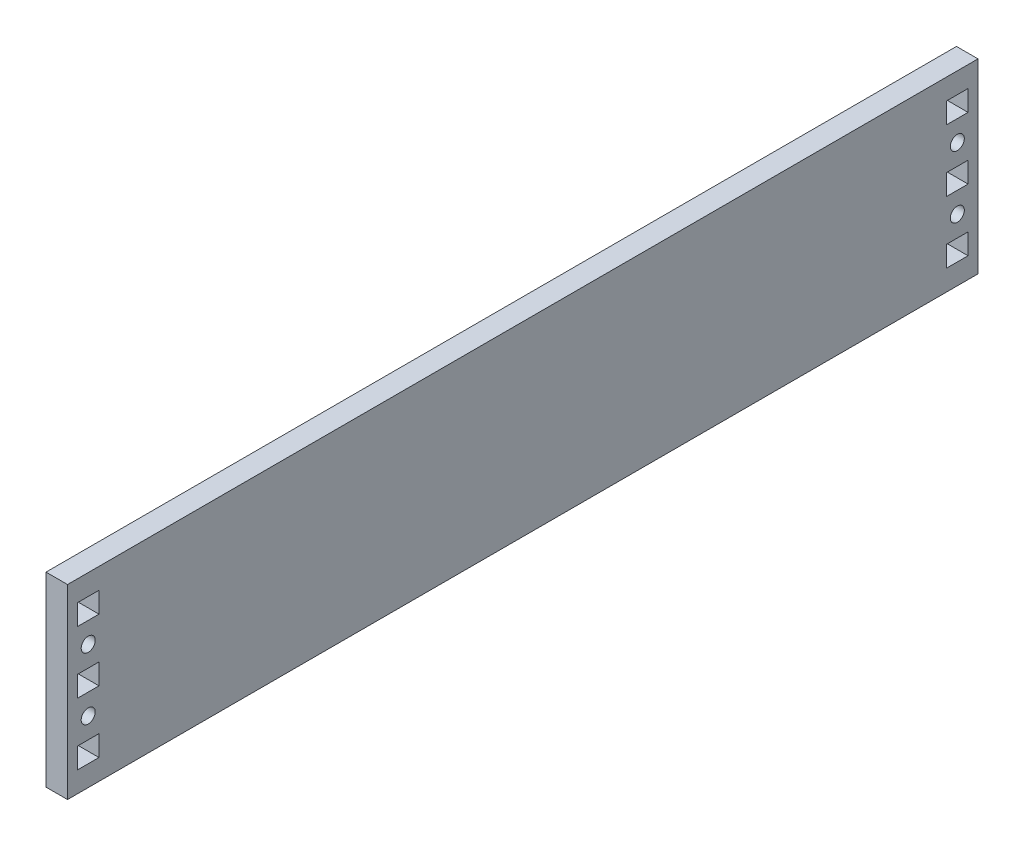
ISO-10303-21;
HEADER;
FILE_DESCRIPTION(('STEP AP214'),'2;1');
FILE_NAME('part.step','',(''),(''),'','','');
FILE_SCHEMA(('AUTOMOTIVE_DESIGN { 1 0 10303 214 1 1 1 1 }'));
ENDSEC;
DATA;
#1=APPLICATION_CONTEXT('core data for automotive mechanical design processes');
#2=APPLICATION_PROTOCOL_DEFINITION('international standard','automotive_design',2000,#1);
#3=PRODUCT_CONTEXT('',#1,'mechanical');
#4=PRODUCT('Part','Part','',(#3));
#5=PRODUCT_RELATED_PRODUCT_CATEGORY('part','',(#4));
#6=PRODUCT_DEFINITION_FORMATION('','',#4);
#7=PRODUCT_DEFINITION_CONTEXT('part definition',#1,'design');
#8=PRODUCT_DEFINITION('design','',#6,#7);
#9=PRODUCT_DEFINITION_SHAPE('','',#8);
#10=(LENGTH_UNIT() NAMED_UNIT(*) SI_UNIT(.MILLI.,.METRE.));
#11=(NAMED_UNIT(*) PLANE_ANGLE_UNIT() SI_UNIT($,.RADIAN.));
#12=(NAMED_UNIT(*) SI_UNIT($,.STERADIAN.) SOLID_ANGLE_UNIT());
#13=UNCERTAINTY_MEASURE_WITH_UNIT(LENGTH_MEASURE(1.E-05),#10,'distance_accuracy_value','');
#14=(GEOMETRIC_REPRESENTATION_CONTEXT(3) GLOBAL_UNCERTAINTY_ASSIGNED_CONTEXT((#13)) GLOBAL_UNIT_ASSIGNED_CONTEXT((#10,
#11,#12)) REPRESENTATION_CONTEXT('',''));
#15=CARTESIAN_POINT('',(0.,0.,0.));
#16=DIRECTION('',(0.,0.,1.));
#17=DIRECTION('',(1.,0.,0.));
#18=AXIS2_PLACEMENT_3D('',#15,#16,#17);
#19=CARTESIAN_POINT('',(6.604,0.,0.));
#20=DIRECTION('',(1.,0.,0.));
#21=DIRECTION('',(0.,0.,-1.));
#22=AXIS2_PLACEMENT_3D('',#19,#20,#21);
#23=PLANE('',#22);
#24=DIRECTION('',(0.,-1.,0.));
#25=VECTOR('',#24,1.);
#26=CARTESIAN_POINT('',(6.604,-15.8749999999995,-130.048));
#27=LINE('',#26,#25);
#28=CARTESIAN_POINT('',(6.604,-15.8749999999995,-130.048));
#29=VERTEX_POINT('',#28);
#30=CARTESIAN_POINT('',(6.604,-22.2249999999995,-130.048));
#31=VERTEX_POINT('',#30);
#32=EDGE_CURVE('E280',#29,#31,#27,.T.);
#33=ORIENTED_EDGE('',*,*,#32,.F.);
#34=DIRECTION('',(0.,0.,1.));
#35=VECTOR('',#34,1.);
#36=CARTESIAN_POINT('',(6.604,-15.8749999999995,-136.652));
#37=LINE('',#36,#35);
#38=CARTESIAN_POINT('',(6.604,-15.8749999999995,-136.652));
#39=VERTEX_POINT('',#38);
#40=EDGE_CURVE('E271',#39,#29,#37,.T.);
#41=ORIENTED_EDGE('',*,*,#40,.F.);
#42=DIRECTION('',(0.,1.,0.));
#43=VECTOR('',#42,1.);
#44=CARTESIAN_POINT('',(6.604,-15.8749999999995,-136.652));
#45=LINE('',#44,#43);
#46=CARTESIAN_POINT('',(6.604,-22.2249999999995,-136.652));
#47=VERTEX_POINT('',#46);
#48=EDGE_CURVE('E299',#47,#39,#45,.T.);
#49=ORIENTED_EDGE('',*,*,#48,.F.);
#50=DIRECTION('',(0.,0.,-1.));
#51=VECTOR('',#50,1.);
#52=CARTESIAN_POINT('',(6.604,-22.2249999999995,-136.652));
#53=LINE('',#52,#51);
#54=EDGE_CURVE('E294',#31,#47,#53,.T.);
#55=ORIENTED_EDGE('',*,*,#54,.F.);
#56=EDGE_LOOP('',(#33,#41,#49,#55));
#57=FACE_BOUND('',#56,.T.);
#58=DIRECTION('',(0.,-1.,0.));
#59=VECTOR('',#58,1.);
#60=CARTESIAN_POINT('',(6.604,15.875,-130.048));
#61=LINE('',#60,#59);
#62=CARTESIAN_POINT('',(6.604,22.225,-130.048));
#63=VERTEX_POINT('',#62);
#64=CARTESIAN_POINT('',(6.604,15.875,-130.048));
#65=VERTEX_POINT('',#64);
#66=EDGE_CURVE('E333',#63,#65,#61,.T.);
#67=ORIENTED_EDGE('',*,*,#66,.F.);
#68=DIRECTION('',(0.,0.,1.));
#69=VECTOR('',#68,1.);
#70=CARTESIAN_POINT('',(6.604,22.225,-130.048));
#71=LINE('',#70,#69);
#72=CARTESIAN_POINT('',(6.604,22.2249999999999,-136.652));
#73=VERTEX_POINT('',#72);
#74=EDGE_CURVE('E330',#73,#63,#71,.T.);
#75=ORIENTED_EDGE('',*,*,#74,.F.);
#76=DIRECTION('',(0.,1.,0.));
#77=VECTOR('',#76,1.);
#78=CARTESIAN_POINT('',(6.604,22.2249999999999,-136.652));
#79=LINE('',#78,#77);
#80=CARTESIAN_POINT('',(6.604,15.8749999999999,-136.652));
#81=VERTEX_POINT('',#80);
#82=EDGE_CURVE('E341',#81,#73,#79,.T.);
#83=ORIENTED_EDGE('',*,*,#82,.F.);
#84=DIRECTION('',(0.,0.,-1.));
#85=VECTOR('',#84,1.);
#86=CARTESIAN_POINT('',(6.604,15.8749999999999,-136.652));
#87=LINE('',#86,#85);
#88=EDGE_CURVE('E337',#65,#81,#87,.T.);
#89=ORIENTED_EDGE('',*,*,#88,.F.);
#90=EDGE_LOOP('',(#67,#75,#83,#89));
#91=FACE_BOUND('',#90,.T.);
#92=CARTESIAN_POINT('',(6.604,-9.52499999999965,133.35));
#93=DIRECTION('',(1.,0.,0.));
#94=DIRECTION('',(0.,0.,-1.));
#95=AXIS2_PLACEMENT_3D('',#92,#93,#94);
#96=CIRCLE('',#95,2.15265);
#97=CARTESIAN_POINT('',(6.604,-9.52499999999965,131.19735));
#98=VERTEX_POINT('',#97);
#99=EDGE_CURVE('E414',#98,#98,#96,.T.);
#100=ORIENTED_EDGE('',*,*,#99,.F.);
#101=EDGE_LOOP('',(#100));
#102=FACE_BOUND('',#101,.T.);
#103=CARTESIAN_POINT('',(6.604,9.52499999999994,133.35));
#104=DIRECTION('',(1.,0.,0.));
#105=DIRECTION('',(0.,0.,-1.));
#106=AXIS2_PLACEMENT_3D('',#103,#104,#105);
#107=CIRCLE('',#106,2.15265);
#108=CARTESIAN_POINT('',(6.604,9.52499999999994,131.19735));
#109=VERTEX_POINT('',#108);
#110=EDGE_CURVE('E465',#109,#109,#107,.T.);
#111=ORIENTED_EDGE('',*,*,#110,.F.);
#112=EDGE_LOOP('',(#111));
#113=FACE_BOUND('',#112,.T.);
#114=DIRECTION('',(0.,-1.,0.));
#115=VECTOR('',#114,1.);
#116=CARTESIAN_POINT('',(6.604,-3.17500000000006,136.652));
#117=LINE('',#116,#115);
#118=CARTESIAN_POINT('',(6.604,3.17499999999992,136.652));
#119=VERTEX_POINT('',#118);
#120=CARTESIAN_POINT('',(6.604,-3.17500000000006,136.652));
#121=VERTEX_POINT('',#120);
#122=EDGE_CURVE('E519',#119,#121,#117,.T.);
#123=ORIENTED_EDGE('',*,*,#122,.F.);
#124=DIRECTION('',(0.,0.,1.));
#125=VECTOR('',#124,1.);
#126=CARTESIAN_POINT('',(6.604,3.17499999999992,136.652));
#127=LINE('',#126,#125);
#128=CARTESIAN_POINT('',(6.604,3.17500000000008,130.048));
#129=VERTEX_POINT('',#128);
#130=EDGE_CURVE('E516',#129,#119,#127,.T.);
#131=ORIENTED_EDGE('',*,*,#130,.F.);
#132=DIRECTION('',(0.,1.,0.));
#133=VECTOR('',#132,1.);
#134=CARTESIAN_POINT('',(6.604,3.17500000000008,130.048));
#135=LINE('',#134,#133);
#136=CARTESIAN_POINT('',(6.604,-3.17500000000008,130.048));
#137=VERTEX_POINT('',#136);
#138=EDGE_CURVE('E527',#137,#129,#135,.T.);
#139=ORIENTED_EDGE('',*,*,#138,.F.);
#140=DIRECTION('',(0.,0.,-1.));
#141=VECTOR('',#140,1.);
#142=CARTESIAN_POINT('',(6.604,-3.17500000000008,130.048));
#143=LINE('',#142,#141);
#144=EDGE_CURVE('E523',#121,#137,#143,.T.);
#145=ORIENTED_EDGE('',*,*,#144,.F.);
#146=EDGE_LOOP('',(#123,#131,#139,#145));
#147=FACE_BOUND('',#146,.T.);
#148=DIRECTION('',(0.,-1.,0.));
#149=VECTOR('',#148,1.);
#150=CARTESIAN_POINT('',(6.604,28.575,139.7));
#151=LINE('',#150,#149);
#152=CARTESIAN_POINT('',(6.604,28.575,139.7));
#153=VERTEX_POINT('',#152);
#154=CARTESIAN_POINT('',(6.604,-28.575,139.7));
#155=VERTEX_POINT('',#154);
#156=EDGE_CURVE('E556',#153,#155,#151,.T.);
#157=ORIENTED_EDGE('',*,*,#156,.T.);
#158=DIRECTION('',(0.,0.,-1.));
#159=VECTOR('',#158,1.);
#160=CARTESIAN_POINT('',(6.604,-28.575,139.7));
#161=LINE('',#160,#159);
#162=CARTESIAN_POINT('',(6.604,-28.575,-139.7));
#163=VERTEX_POINT('',#162);
#164=EDGE_CURVE('E560',#155,#163,#161,.T.);
#165=ORIENTED_EDGE('',*,*,#164,.T.);
#166=DIRECTION('',(0.,1.,0.));
#167=VECTOR('',#166,1.);
#168=CARTESIAN_POINT('',(6.604,28.575,-139.7));
#169=LINE('',#168,#167);
#170=CARTESIAN_POINT('',(6.604,28.575,-139.7));
#171=VERTEX_POINT('',#170);
#172=EDGE_CURVE('E564',#163,#171,#169,.T.);
#173=ORIENTED_EDGE('',*,*,#172,.T.);
#174=DIRECTION('',(0.,0.,1.));
#175=VECTOR('',#174,1.);
#176=CARTESIAN_POINT('',(6.604,28.575,139.7));
#177=LINE('',#176,#175);
#178=EDGE_CURVE('E567',#171,#153,#177,.T.);
#179=ORIENTED_EDGE('',*,*,#178,.T.);
#180=EDGE_LOOP('',(#157,#165,#173,#179));
#181=FACE_BOUND('',#180,.T.);
#182=DIRECTION('',(0.,-1.,0.));
#183=VECTOR('',#182,1.);
#184=CARTESIAN_POINT('',(6.604,15.875,136.652));
#185=LINE('',#184,#183);
#186=CARTESIAN_POINT('',(6.604,22.2249999999999,136.652));
#187=VERTEX_POINT('',#186);
#188=CARTESIAN_POINT('',(6.604,15.875,136.652));
#189=VERTEX_POINT('',#188);
#190=EDGE_CURVE('E476',#187,#189,#185,.T.);
#191=ORIENTED_EDGE('',*,*,#190,.F.);
#192=DIRECTION('',(0.,0.,1.));
#193=VECTOR('',#192,1.);
#194=CARTESIAN_POINT('',(6.604,22.2249999999999,136.652));
#195=LINE('',#194,#193);
#196=CARTESIAN_POINT('',(6.604,22.2249999999998,130.048));
#197=VERTEX_POINT('',#196);
#198=EDGE_CURVE('E473',#197,#187,#195,.T.);
#199=ORIENTED_EDGE('',*,*,#198,.F.);
#200=DIRECTION('',(0.,1.,0.));
#201=VECTOR('',#200,1.);
#202=CARTESIAN_POINT('',(6.604,22.2249999999998,130.048));
#203=LINE('',#202,#201);
#204=CARTESIAN_POINT('',(6.604,15.8749999999998,130.048));
#205=VERTEX_POINT('',#204);
#206=EDGE_CURVE('E484',#205,#197,#203,.T.);
#207=ORIENTED_EDGE('',*,*,#206,.F.);
#208=DIRECTION('',(0.,0.,-1.));
#209=VECTOR('',#208,1.);
#210=CARTESIAN_POINT('',(6.604,15.8749999999998,130.048));
#211=LINE('',#210,#209);
#212=EDGE_CURVE('E480',#189,#205,#211,.T.);
#213=ORIENTED_EDGE('',*,*,#212,.F.);
#214=EDGE_LOOP('',(#191,#199,#207,#213));
#215=FACE_BOUND('',#214,.T.);
#216=DIRECTION('',(0.,-1.,0.));
#217=VECTOR('',#216,1.);
#218=CARTESIAN_POINT('',(6.604,-15.8749999999995,136.652));
#219=LINE('',#218,#217);
#220=CARTESIAN_POINT('',(6.604,-15.8749999999995,136.652));
#221=VERTEX_POINT('',#220);
#222=CARTESIAN_POINT('',(6.604,-22.2249999999995,136.652));
#223=VERTEX_POINT('',#222);
#224=EDGE_CURVE('E425',#221,#223,#219,.T.);
#225=ORIENTED_EDGE('',*,*,#224,.F.);
#226=DIRECTION('',(0.,0.,1.));
#227=VECTOR('',#226,1.);
#228=CARTESIAN_POINT('',(6.604,-15.8749999999995,130.048));
#229=LINE('',#228,#227);
#230=CARTESIAN_POINT('',(6.604,-15.8749999999995,130.048));
#231=VERTEX_POINT('',#230);
#232=EDGE_CURVE('E422',#231,#221,#229,.T.);
#233=ORIENTED_EDGE('',*,*,#232,.F.);
#234=DIRECTION('',(0.,1.,0.));
#235=VECTOR('',#234,1.);
#236=CARTESIAN_POINT('',(6.604,-15.8749999999995,130.048));
#237=LINE('',#236,#235);
#238=CARTESIAN_POINT('',(6.604,-22.2249999999995,130.048));
#239=VERTEX_POINT('',#238);
#240=EDGE_CURVE('E433',#239,#231,#237,.T.);
#241=ORIENTED_EDGE('',*,*,#240,.F.);
#242=DIRECTION('',(0.,0.,-1.));
#243=VECTOR('',#242,1.);
#244=CARTESIAN_POINT('',(6.604,-22.2249999999995,130.048));
#245=LINE('',#244,#243);
#246=EDGE_CURVE('E429',#223,#239,#245,.T.);
#247=ORIENTED_EDGE('',*,*,#246,.F.);
#248=EDGE_LOOP('',(#225,#233,#241,#247));
#249=FACE_BOUND('',#248,.T.);
#250=DIRECTION('',(0.,-1.,0.));
#251=VECTOR('',#250,1.);
#252=CARTESIAN_POINT('',(6.604,-3.17499999999999,-130.048));
#253=LINE('',#252,#251);
#254=CARTESIAN_POINT('',(6.604,3.17499999999999,-130.048));
#255=VERTEX_POINT('',#254);
#256=CARTESIAN_POINT('',(6.604,-3.17499999999999,-130.048));
#257=VERTEX_POINT('',#256);
#258=EDGE_CURVE('E374',#255,#257,#253,.T.);
#259=ORIENTED_EDGE('',*,*,#258,.F.);
#260=DIRECTION('',(0.,0.,1.));
#261=VECTOR('',#260,1.);
#262=CARTESIAN_POINT('',(6.604,3.17499999999999,-130.048));
#263=LINE('',#262,#261);
#264=CARTESIAN_POINT('',(6.604,3.17500000000015,-136.652));
#265=VERTEX_POINT('',#264);
#266=EDGE_CURVE('E371',#265,#255,#263,.T.);
#267=ORIENTED_EDGE('',*,*,#266,.F.);
#268=DIRECTION('',(0.,1.,0.));
#269=VECTOR('',#268,1.);
#270=CARTESIAN_POINT('',(6.604,3.17500000000015,-136.652));
#271=LINE('',#270,#269);
#272=CARTESIAN_POINT('',(6.604,-3.17500000000001,-136.652));
#273=VERTEX_POINT('',#272);
#274=EDGE_CURVE('E382',#273,#265,#271,.T.);
#275=ORIENTED_EDGE('',*,*,#274,.F.);
#276=DIRECTION('',(0.,0.,-1.));
#277=VECTOR('',#276,1.);
#278=CARTESIAN_POINT('',(6.604,-3.17500000000001,-136.652));
#279=LINE('',#278,#277);
#280=EDGE_CURVE('E378',#257,#273,#279,.T.);
#281=ORIENTED_EDGE('',*,*,#280,.F.);
#282=EDGE_LOOP('',(#259,#267,#275,#281));
#283=FACE_BOUND('',#282,.T.);
#284=CARTESIAN_POINT('',(6.604,9.52500000000001,-133.35));
#285=DIRECTION('',(1.,0.,0.));
#286=DIRECTION('',(0.,0.,-1.));
#287=AXIS2_PLACEMENT_3D('',#284,#285,#286);
#288=CIRCLE('',#287,2.15265);
#289=CARTESIAN_POINT('',(6.604,9.52500000000001,-135.50265));
#290=VERTEX_POINT('',#289);
#291=EDGE_CURVE('E322',#290,#290,#288,.T.);
#292=ORIENTED_EDGE('',*,*,#291,.F.);
#293=EDGE_LOOP('',(#292));
#294=FACE_BOUND('',#293,.T.);
#295=CARTESIAN_POINT('',(6.604,-9.52499999999959,-133.35));
#296=DIRECTION('',(1.,0.,0.));
#297=DIRECTION('',(0.,0.,-1.));
#298=AXIS2_PLACEMENT_3D('',#295,#296,#297);
#299=CIRCLE('',#298,2.15265);
#300=CARTESIAN_POINT('',(6.604,-9.52499999999959,-135.50265));
#301=VERTEX_POINT('',#300);
#302=EDGE_CURVE('E307',#301,#301,#299,.T.);
#303=ORIENTED_EDGE('',*,*,#302,.F.);
#304=EDGE_LOOP('',(#303));
#305=FACE_BOUND('',#304,.T.);
#306=ADVANCED_FACE('F39',(#57,#91,#102,#113,#147,#181,#215,#249,#283,#294,#305),#23,.T.);
#307=CARTESIAN_POINT('',(0.,0.,0.));
#308=DIRECTION('',(1.,0.,0.));
#309=DIRECTION('',(0.,0.,-1.));
#310=AXIS2_PLACEMENT_3D('',#307,#308,#309);
#311=PLANE('',#310);
#312=DIRECTION('',(0.,0.,1.));
#313=VECTOR('',#312,1.);
#314=CARTESIAN_POINT('',(0.,-15.8749999999995,-136.652));
#315=LINE('',#314,#313);
#316=CARTESIAN_POINT('',(0.,-15.8749999999995,-136.652));
#317=VERTEX_POINT('',#316);
#318=CARTESIAN_POINT('',(0.,-15.8749999999995,-130.048));
#319=VERTEX_POINT('',#318);
#320=EDGE_CURVE('E69',#317,#319,#315,.T.);
#321=ORIENTED_EDGE('',*,*,#320,.T.);
#322=DIRECTION('',(0.,-1.,0.));
#323=VECTOR('',#322,1.);
#324=CARTESIAN_POINT('',(0.,-15.8749999999995,-130.048));
#325=LINE('',#324,#323);
#326=CARTESIAN_POINT('',(0.,-22.2249999999995,-130.048));
#327=VERTEX_POINT('',#326);
#328=EDGE_CURVE('E287',#319,#327,#325,.T.);
#329=ORIENTED_EDGE('',*,*,#328,.T.);
#330=DIRECTION('',(0.,0.,-1.));
#331=VECTOR('',#330,1.);
#332=CARTESIAN_POINT('',(0.,-22.2249999999995,-136.652));
#333=LINE('',#332,#331);
#334=CARTESIAN_POINT('',(0.,-22.2249999999995,-136.652));
#335=VERTEX_POINT('',#334);
#336=EDGE_CURVE('E310',#327,#335,#333,.T.);
#337=ORIENTED_EDGE('',*,*,#336,.T.);
#338=DIRECTION('',(0.,1.,0.));
#339=VECTOR('',#338,1.);
#340=CARTESIAN_POINT('',(0.,-15.8749999999995,-136.652));
#341=LINE('',#340,#339);
#342=EDGE_CURVE('E281',#335,#317,#341,.T.);
#343=ORIENTED_EDGE('',*,*,#342,.T.);
#344=EDGE_LOOP('',(#321,#329,#337,#343));
#345=FACE_BOUND('',#344,.T.);
#346=DIRECTION('',(0.,0.,1.));
#347=VECTOR('',#346,1.);
#348=CARTESIAN_POINT('',(0.,22.225,-130.048));
#349=LINE('',#348,#347);
#350=CARTESIAN_POINT('',(0.,22.2249999999999,-136.652));
#351=VERTEX_POINT('',#350);
#352=CARTESIAN_POINT('',(0.,22.225,-130.048));
#353=VERTEX_POINT('',#352);
#354=EDGE_CURVE('E326',#351,#353,#349,.T.);
#355=ORIENTED_EDGE('',*,*,#354,.T.);
#356=DIRECTION('',(0.,-1.,0.));
#357=VECTOR('',#356,1.);
#358=CARTESIAN_POINT('',(0.,15.875,-130.048));
#359=LINE('',#358,#357);
#360=CARTESIAN_POINT('',(0.,15.875,-130.048));
#361=VERTEX_POINT('',#360);
#362=EDGE_CURVE('E347',#353,#361,#359,.T.);
#363=ORIENTED_EDGE('',*,*,#362,.T.);
#364=DIRECTION('',(0.,0.,-1.));
#365=VECTOR('',#364,1.);
#366=CARTESIAN_POINT('',(0.,15.8749999999999,-136.652));
#367=LINE('',#366,#365);
#368=CARTESIAN_POINT('',(0.,15.8749999999999,-136.652));
#369=VERTEX_POINT('',#368);
#370=EDGE_CURVE('E351',#361,#369,#367,.T.);
#371=ORIENTED_EDGE('',*,*,#370,.T.);
#372=DIRECTION('',(0.,1.,0.));
#373=VECTOR('',#372,1.);
#374=CARTESIAN_POINT('',(0.,22.2249999999999,-136.652));
#375=LINE('',#374,#373);
#376=EDGE_CURVE('E334',#369,#351,#375,.T.);
#377=ORIENTED_EDGE('',*,*,#376,.T.);
#378=EDGE_LOOP('',(#355,#363,#371,#377));
#379=FACE_BOUND('',#378,.T.);
#380=CARTESIAN_POINT('',(0.,-9.52499999999965,133.35));
#381=DIRECTION('',(1.,0.,0.));
#382=DIRECTION('',(0.,0.,-1.));
#383=AXIS2_PLACEMENT_3D('',#380,#381,#382);
#384=CIRCLE('',#383,2.15265);
#385=CARTESIAN_POINT('',(0.,-9.52499999999965,131.19735));
#386=VERTEX_POINT('',#385);
#387=EDGE_CURVE('E413',#386,#386,#384,.T.);
#388=ORIENTED_EDGE('',*,*,#387,.T.);
#389=EDGE_LOOP('',(#388));
#390=FACE_BOUND('',#389,.T.);
#391=CARTESIAN_POINT('',(0.,9.52499999999994,133.35));
#392=DIRECTION('',(1.,0.,0.));
#393=DIRECTION('',(0.,0.,-1.));
#394=AXIS2_PLACEMENT_3D('',#391,#392,#393);
#395=CIRCLE('',#394,2.15265);
#396=CARTESIAN_POINT('',(0.,9.52499999999994,131.19735));
#397=VERTEX_POINT('',#396);
#398=EDGE_CURVE('E464',#397,#397,#395,.T.);
#399=ORIENTED_EDGE('',*,*,#398,.T.);
#400=EDGE_LOOP('',(#399));
#401=FACE_BOUND('',#400,.T.);
#402=DIRECTION('',(0.,0.,1.));
#403=VECTOR('',#402,1.);
#404=CARTESIAN_POINT('',(0.,3.17499999999992,136.652));
#405=LINE('',#404,#403);
#406=CARTESIAN_POINT('',(0.,3.17500000000008,130.048));
#407=VERTEX_POINT('',#406);
#408=CARTESIAN_POINT('',(0.,3.17499999999992,136.652));
#409=VERTEX_POINT('',#408);
#410=EDGE_CURVE('E515',#407,#409,#405,.T.);
#411=ORIENTED_EDGE('',*,*,#410,.T.);
#412=DIRECTION('',(0.,-1.,0.));
#413=VECTOR('',#412,1.);
#414=CARTESIAN_POINT('',(0.,-3.17500000000006,136.652));
#415=LINE('',#414,#413);
#416=CARTESIAN_POINT('',(0.,-3.17500000000006,136.652));
#417=VERTEX_POINT('',#416);
#418=EDGE_CURVE('E534',#409,#417,#415,.T.);
#419=ORIENTED_EDGE('',*,*,#418,.T.);
#420=DIRECTION('',(0.,0.,-1.));
#421=VECTOR('',#420,1.);
#422=CARTESIAN_POINT('',(0.,-3.17500000000008,130.048));
#423=LINE('',#422,#421);
#424=CARTESIAN_POINT('',(0.,-3.17500000000008,130.048));
#425=VERTEX_POINT('',#424);
#426=EDGE_CURVE('E538',#417,#425,#423,.T.);
#427=ORIENTED_EDGE('',*,*,#426,.T.);
#428=DIRECTION('',(0.,1.,0.));
#429=VECTOR('',#428,1.);
#430=CARTESIAN_POINT('',(0.,3.17500000000008,130.048));
#431=LINE('',#430,#429);
#432=EDGE_CURVE('E520',#425,#407,#431,.T.);
#433=ORIENTED_EDGE('',*,*,#432,.T.);
#434=EDGE_LOOP('',(#411,#419,#427,#433));
#435=FACE_BOUND('',#434,.T.);
#436=DIRECTION('',(0.,-1.,0.));
#437=VECTOR('',#436,1.);
#438=CARTESIAN_POINT('',(0.,28.575,139.7));
#439=LINE('',#438,#437);
#440=CARTESIAN_POINT('',(0.,28.575,139.7));
#441=VERTEX_POINT('',#440);
#442=CARTESIAN_POINT('',(0.,-28.575,139.7));
#443=VERTEX_POINT('',#442);
#444=EDGE_CURVE('E555',#441,#443,#439,.T.);
#445=ORIENTED_EDGE('',*,*,#444,.F.);
#446=DIRECTION('',(0.,0.,1.));
#447=VECTOR('',#446,1.);
#448=CARTESIAN_POINT('',(0.,28.575,139.7));
#449=LINE('',#448,#447);
#450=CARTESIAN_POINT('',(0.,28.575,-139.7));
#451=VERTEX_POINT('',#450);
#452=EDGE_CURVE('E561',#451,#441,#449,.T.);
#453=ORIENTED_EDGE('',*,*,#452,.F.);
#454=DIRECTION('',(0.,1.,0.));
#455=VECTOR('',#454,1.);
#456=CARTESIAN_POINT('',(0.,28.575,-139.7));
#457=LINE('',#456,#455);
#458=CARTESIAN_POINT('',(0.,-28.575,-139.7));
#459=VERTEX_POINT('',#458);
#460=EDGE_CURVE('E577',#459,#451,#457,.T.);
#461=ORIENTED_EDGE('',*,*,#460,.F.);
#462=DIRECTION('',(0.,0.,-1.));
#463=VECTOR('',#462,1.);
#464=CARTESIAN_POINT('',(0.,-28.575,139.7));
#465=LINE('',#464,#463);
#466=EDGE_CURVE('E574',#443,#459,#465,.T.);
#467=ORIENTED_EDGE('',*,*,#466,.F.);
#468=EDGE_LOOP('',(#445,#453,#461,#467));
#469=FACE_BOUND('',#468,.T.);
#470=DIRECTION('',(0.,0.,1.));
#471=VECTOR('',#470,1.);
#472=CARTESIAN_POINT('',(0.,22.2249999999999,136.652));
#473=LINE('',#472,#471);
#474=CARTESIAN_POINT('',(0.,22.2249999999998,130.048));
#475=VERTEX_POINT('',#474);
#476=CARTESIAN_POINT('',(0.,22.2249999999999,136.652));
#477=VERTEX_POINT('',#476);
#478=EDGE_CURVE('E469',#475,#477,#473,.T.);
#479=ORIENTED_EDGE('',*,*,#478,.T.);
#480=DIRECTION('',(0.,-1.,0.));
#481=VECTOR('',#480,1.);
#482=CARTESIAN_POINT('',(0.,15.875,136.652));
#483=LINE('',#482,#481);
#484=CARTESIAN_POINT('',(0.,15.875,136.652));
#485=VERTEX_POINT('',#484);
#486=EDGE_CURVE('E491',#477,#485,#483,.T.);
#487=ORIENTED_EDGE('',*,*,#486,.T.);
#488=DIRECTION('',(0.,0.,-1.));
#489=VECTOR('',#488,1.);
#490=CARTESIAN_POINT('',(0.,15.8749999999998,130.048));
#491=LINE('',#490,#489);
#492=CARTESIAN_POINT('',(0.,15.8749999999998,130.048));
#493=VERTEX_POINT('',#492);
#494=EDGE_CURVE('E495',#485,#493,#491,.T.);
#495=ORIENTED_EDGE('',*,*,#494,.T.);
#496=DIRECTION('',(0.,1.,0.));
#497=VECTOR('',#496,1.);
#498=CARTESIAN_POINT('',(0.,22.2249999999998,130.048));
#499=LINE('',#498,#497);
#500=EDGE_CURVE('E477',#493,#475,#499,.T.);
#501=ORIENTED_EDGE('',*,*,#500,.T.);
#502=EDGE_LOOP('',(#479,#487,#495,#501));
#503=FACE_BOUND('',#502,.T.);
#504=DIRECTION('',(0.,0.,1.));
#505=VECTOR('',#504,1.);
#506=CARTESIAN_POINT('',(0.,-15.8749999999995,130.048));
#507=LINE('',#506,#505);
#508=CARTESIAN_POINT('',(0.,-15.8749999999995,130.048));
#509=VERTEX_POINT('',#508);
#510=CARTESIAN_POINT('',(0.,-15.8749999999995,136.652));
#511=VERTEX_POINT('',#510);
#512=EDGE_CURVE('E418',#509,#511,#507,.T.);
#513=ORIENTED_EDGE('',*,*,#512,.T.);
#514=DIRECTION('',(0.,-1.,0.));
#515=VECTOR('',#514,1.);
#516=CARTESIAN_POINT('',(0.,-15.8749999999995,136.652));
#517=LINE('',#516,#515);
#518=CARTESIAN_POINT('',(0.,-22.2249999999995,136.652));
#519=VERTEX_POINT('',#518);
#520=EDGE_CURVE('E440',#511,#519,#517,.T.);
#521=ORIENTED_EDGE('',*,*,#520,.T.);
#522=DIRECTION('',(0.,0.,-1.));
#523=VECTOR('',#522,1.);
#524=CARTESIAN_POINT('',(0.,-22.2249999999995,130.048));
#525=LINE('',#524,#523);
#526=CARTESIAN_POINT('',(0.,-22.2249999999995,130.048));
#527=VERTEX_POINT('',#526);
#528=EDGE_CURVE('E444',#519,#527,#525,.T.);
#529=ORIENTED_EDGE('',*,*,#528,.T.);
#530=DIRECTION('',(0.,1.,0.));
#531=VECTOR('',#530,1.);
#532=CARTESIAN_POINT('',(0.,-15.8749999999995,130.048));
#533=LINE('',#532,#531);
#534=EDGE_CURVE('E426',#527,#509,#533,.T.);
#535=ORIENTED_EDGE('',*,*,#534,.T.);
#536=EDGE_LOOP('',(#513,#521,#529,#535));
#537=FACE_BOUND('',#536,.T.);
#538=DIRECTION('',(0.,0.,1.));
#539=VECTOR('',#538,1.);
#540=CARTESIAN_POINT('',(0.,3.17499999999999,-130.048));
#541=LINE('',#540,#539);
#542=CARTESIAN_POINT('',(0.,3.17500000000015,-136.652));
#543=VERTEX_POINT('',#542);
#544=CARTESIAN_POINT('',(0.,3.17499999999999,-130.048));
#545=VERTEX_POINT('',#544);
#546=EDGE_CURVE('E370',#543,#545,#541,.T.);
#547=ORIENTED_EDGE('',*,*,#546,.T.);
#548=DIRECTION('',(0.,-1.,0.));
#549=VECTOR('',#548,1.);
#550=CARTESIAN_POINT('',(0.,-3.17499999999999,-130.048));
#551=LINE('',#550,#549);
#552=CARTESIAN_POINT('',(0.,-3.17499999999999,-130.048));
#553=VERTEX_POINT('',#552);
#554=EDGE_CURVE('E389',#545,#553,#551,.T.);
#555=ORIENTED_EDGE('',*,*,#554,.T.);
#556=DIRECTION('',(0.,0.,-1.));
#557=VECTOR('',#556,1.);
#558=CARTESIAN_POINT('',(0.,-3.17500000000001,-136.652));
#559=LINE('',#558,#557);
#560=CARTESIAN_POINT('',(0.,-3.17500000000001,-136.652));
#561=VERTEX_POINT('',#560);
#562=EDGE_CURVE('E393',#553,#561,#559,.T.);
#563=ORIENTED_EDGE('',*,*,#562,.T.);
#564=DIRECTION('',(0.,1.,0.));
#565=VECTOR('',#564,1.);
#566=CARTESIAN_POINT('',(0.,3.17500000000015,-136.652));
#567=LINE('',#566,#565);
#568=EDGE_CURVE('E375',#561,#543,#567,.T.);
#569=ORIENTED_EDGE('',*,*,#568,.T.);
#570=EDGE_LOOP('',(#547,#555,#563,#569));
#571=FACE_BOUND('',#570,.T.);
#572=CARTESIAN_POINT('',(0.,9.52500000000001,-133.35));
#573=DIRECTION('',(1.,0.,0.));
#574=DIRECTION('',(0.,0.,-1.));
#575=AXIS2_PLACEMENT_3D('',#572,#573,#574);
#576=CIRCLE('',#575,2.15265);
#577=CARTESIAN_POINT('',(0.,9.52500000000001,-135.50265));
#578=VERTEX_POINT('',#577);
#579=EDGE_CURVE('E289',#578,#578,#576,.T.);
#580=ORIENTED_EDGE('',*,*,#579,.T.);
#581=EDGE_LOOP('',(#580));
#582=FACE_BOUND('',#581,.T.);
#583=CARTESIAN_POINT('',(0.,-9.52499999999959,-133.35));
#584=DIRECTION('',(1.,0.,0.));
#585=DIRECTION('',(0.,0.,-1.));
#586=AXIS2_PLACEMENT_3D('',#583,#584,#585);
#587=CIRCLE('',#586,2.15265);
#588=CARTESIAN_POINT('',(0.,-9.52499999999959,-135.50265));
#589=VERTEX_POINT('',#588);
#590=EDGE_CURVE('E757',#589,#589,#587,.T.);
#591=ORIENTED_EDGE('',*,*,#590,.T.);
#592=EDGE_LOOP('',(#591));
#593=FACE_BOUND('',#592,.T.);
#594=ADVANCED_FACE('F599',(#345,#379,#390,#401,#435,#469,#503,#537,#571,#582,#593),#311,.F.);
#595=CARTESIAN_POINT('',(6.604,28.575,139.7));
#596=DIRECTION('',(0.,0.,-1.));
#597=DIRECTION('',(0.,1.,0.));
#598=AXIS2_PLACEMENT_3D('',#595,#596,#597);
#599=PLANE('',#598);
#600=ORIENTED_EDGE('',*,*,#444,.T.);
#601=DIRECTION('',(-1.,0.,0.));
#602=VECTOR('',#601,1.);
#603=CARTESIAN_POINT('',(6.604,-28.575,139.7));
#604=LINE('',#603,#602);
#605=EDGE_CURVE('E11',#155,#443,#604,.T.);
#606=ORIENTED_EDGE('',*,*,#605,.F.);
#607=ORIENTED_EDGE('',*,*,#156,.F.);
#608=DIRECTION('',(-1.,0.,0.));
#609=VECTOR('',#608,1.);
#610=CARTESIAN_POINT('',(6.604,28.575,139.7));
#611=LINE('',#610,#609);
#612=EDGE_CURVE('E570',#153,#441,#611,.T.);
#613=ORIENTED_EDGE('',*,*,#612,.T.);
#614=EDGE_LOOP('',(#600,#606,#607,#613));
#615=FACE_BOUND('',#614,.T.);
#616=ADVANCED_FACE('F41',(#615),#599,.F.);
#617=CARTESIAN_POINT('',(6.604,-28.575,139.7));
#618=DIRECTION('',(0.,1.,0.));
#619=DIRECTION('',(0.,0.,1.));
#620=AXIS2_PLACEMENT_3D('',#617,#618,#619);
#621=PLANE('',#620);
#622=ORIENTED_EDGE('',*,*,#466,.T.);
#623=DIRECTION('',(-1.,0.,0.));
#624=VECTOR('',#623,1.);
#625=CARTESIAN_POINT('',(6.604,-28.575,-139.7));
#626=LINE('',#625,#624);
#627=EDGE_CURVE('E48',#163,#459,#626,.T.);
#628=ORIENTED_EDGE('',*,*,#627,.F.);
#629=ORIENTED_EDGE('',*,*,#164,.F.);
#630=ORIENTED_EDGE('',*,*,#605,.T.);
#631=EDGE_LOOP('',(#622,#628,#629,#630));
#632=FACE_BOUND('',#631,.T.);
#633=ADVANCED_FACE('F610',(#632),#621,.F.);
#634=CARTESIAN_POINT('',(6.604,28.575,-139.7));
#635=DIRECTION('',(0.,0.,1.));
#636=DIRECTION('',(1.,0.,0.));
#637=AXIS2_PLACEMENT_3D('',#634,#635,#636);
#638=PLANE('',#637);
#639=ORIENTED_EDGE('',*,*,#460,.T.);
#640=DIRECTION('',(-1.,0.,0.));
#641=VECTOR('',#640,1.);
#642=CARTESIAN_POINT('',(6.604,28.575,-139.7));
#643=LINE('',#642,#641);
#644=EDGE_CURVE('E584',#171,#451,#643,.T.);
#645=ORIENTED_EDGE('',*,*,#644,.F.);
#646=ORIENTED_EDGE('',*,*,#172,.F.);
#647=ORIENTED_EDGE('',*,*,#627,.T.);
#648=EDGE_LOOP('',(#639,#645,#646,#647));
#649=FACE_BOUND('',#648,.T.);
#650=ADVANCED_FACE('F593',(#649),#638,.F.);
#651=CARTESIAN_POINT('',(6.604,28.575,139.7));
#652=DIRECTION('',(0.,-1.,0.));
#653=DIRECTION('',(0.,0.,-1.));
#654=AXIS2_PLACEMENT_3D('',#651,#652,#653);
#655=PLANE('',#654);
#656=ORIENTED_EDGE('',*,*,#452,.T.);
#657=ORIENTED_EDGE('',*,*,#612,.F.);
#658=ORIENTED_EDGE('',*,*,#178,.F.);
#659=ORIENTED_EDGE('',*,*,#644,.T.);
#660=EDGE_LOOP('',(#656,#657,#658,#659));
#661=FACE_BOUND('',#660,.T.);
#662=ADVANCED_FACE('F603',(#661),#655,.F.);
#663=CARTESIAN_POINT('',(6.604,3.17499999999992,136.652));
#664=DIRECTION('',(0.,-1.,0.));
#665=DIRECTION('',(0.,0.,-1.));
#666=AXIS2_PLACEMENT_3D('',#663,#664,#665);
#667=PLANE('',#666);
#668=ORIENTED_EDGE('',*,*,#410,.F.);
#669=DIRECTION('',(-1.,0.,0.));
#670=VECTOR('',#669,1.);
#671=CARTESIAN_POINT('',(6.604,3.17500000000008,130.048));
#672=LINE('',#671,#670);
#673=EDGE_CURVE('E530',#129,#407,#672,.T.);
#674=ORIENTED_EDGE('',*,*,#673,.F.);
#675=ORIENTED_EDGE('',*,*,#130,.T.);
#676=DIRECTION('',(-1.,0.,0.));
#677=VECTOR('',#676,1.);
#678=CARTESIAN_POINT('',(6.604,3.17499999999992,136.652));
#679=LINE('',#678,#677);
#680=EDGE_CURVE('E551',#119,#409,#679,.T.);
#681=ORIENTED_EDGE('',*,*,#680,.T.);
#682=EDGE_LOOP('',(#668,#674,#675,#681));
#683=FACE_BOUND('',#682,.T.);
#684=ADVANCED_FACE('F625',(#683),#667,.T.);
#685=CARTESIAN_POINT('',(6.604,-3.17500000000006,136.652));
#686=DIRECTION('',(0.,0.,-1.));
#687=DIRECTION('',(0.,1.,0.));
#688=AXIS2_PLACEMENT_3D('',#685,#686,#687);
#689=PLANE('',#688);
#690=ORIENTED_EDGE('',*,*,#418,.F.);
#691=ORIENTED_EDGE('',*,*,#680,.F.);
#692=ORIENTED_EDGE('',*,*,#122,.T.);
#693=DIRECTION('',(-1.,0.,0.));
#694=VECTOR('',#693,1.);
#695=CARTESIAN_POINT('',(6.604,-3.17500000000006,136.652));
#696=LINE('',#695,#694);
#697=EDGE_CURVE('E549',#121,#417,#696,.T.);
#698=ORIENTED_EDGE('',*,*,#697,.T.);
#699=EDGE_LOOP('',(#690,#691,#692,#698));
#700=FACE_BOUND('',#699,.T.);
#701=ADVANCED_FACE('F632',(#700),#689,.T.);
#702=CARTESIAN_POINT('',(6.604,-3.17500000000008,130.048));
#703=DIRECTION('',(0.,1.,0.));
#704=DIRECTION('',(0.,0.,1.));
#705=AXIS2_PLACEMENT_3D('',#702,#703,#704);
#706=PLANE('',#705);
#707=ORIENTED_EDGE('',*,*,#426,.F.);
#708=ORIENTED_EDGE('',*,*,#697,.F.);
#709=ORIENTED_EDGE('',*,*,#144,.T.);
#710=DIRECTION('',(-1.,0.,0.));
#711=VECTOR('',#710,1.);
#712=CARTESIAN_POINT('',(6.604,-3.17500000000008,130.048));
#713=LINE('',#712,#711);
#714=EDGE_CURVE('E546',#137,#425,#713,.T.);
#715=ORIENTED_EDGE('',*,*,#714,.T.);
#716=EDGE_LOOP('',(#707,#708,#709,#715));
#717=FACE_BOUND('',#716,.T.);
#718=ADVANCED_FACE('F637',(#717),#706,.T.);
#719=CARTESIAN_POINT('',(6.604,3.17500000000008,130.048));
#720=DIRECTION('',(0.,0.,1.));
#721=DIRECTION('',(1.,0.,0.));
#722=AXIS2_PLACEMENT_3D('',#719,#720,#721);
#723=PLANE('',#722);
#724=ORIENTED_EDGE('',*,*,#432,.F.);
#725=ORIENTED_EDGE('',*,*,#714,.F.);
#726=ORIENTED_EDGE('',*,*,#138,.T.);
#727=ORIENTED_EDGE('',*,*,#673,.T.);
#728=EDGE_LOOP('',(#724,#725,#726,#727));
#729=FACE_BOUND('',#728,.T.);
#730=ADVANCED_FACE('F645',(#729),#723,.T.);
#731=CARTESIAN_POINT('',(6.604,22.2249999999999,136.652));
#732=DIRECTION('',(0.,-1.,0.));
#733=DIRECTION('',(0.,0.,-1.));
#734=AXIS2_PLACEMENT_3D('',#731,#732,#733);
#735=PLANE('',#734);
#736=ORIENTED_EDGE('',*,*,#478,.F.);
#737=DIRECTION('',(-1.,0.,0.));
#738=VECTOR('',#737,1.);
#739=CARTESIAN_POINT('',(6.604,22.2249999999998,130.048));
#740=LINE('',#739,#738);
#741=EDGE_CURVE('E487',#197,#475,#740,.T.);
#742=ORIENTED_EDGE('',*,*,#741,.F.);
#743=ORIENTED_EDGE('',*,*,#198,.T.);
#744=DIRECTION('',(-1.,0.,0.));
#745=VECTOR('',#744,1.);
#746=CARTESIAN_POINT('',(6.604,22.2249999999999,136.652));
#747=LINE('',#746,#745);
#748=EDGE_CURVE('E511',#187,#477,#747,.T.);
#749=ORIENTED_EDGE('',*,*,#748,.T.);
#750=EDGE_LOOP('',(#736,#742,#743,#749));
#751=FACE_BOUND('',#750,.T.);
#752=ADVANCED_FACE('F658',(#751),#735,.T.);
#753=CARTESIAN_POINT('',(6.604,15.875,136.652));
#754=DIRECTION('',(0.,0.,-1.));
#755=DIRECTION('',(0.,1.,0.));
#756=AXIS2_PLACEMENT_3D('',#753,#754,#755);
#757=PLANE('',#756);
#758=ORIENTED_EDGE('',*,*,#486,.F.);
#759=ORIENTED_EDGE('',*,*,#748,.F.);
#760=ORIENTED_EDGE('',*,*,#190,.T.);
#761=DIRECTION('',(-1.,0.,0.));
#762=VECTOR('',#761,1.);
#763=CARTESIAN_POINT('',(6.604,15.875,136.652));
#764=LINE('',#763,#762);
#765=EDGE_CURVE('E508',#189,#485,#764,.T.);
#766=ORIENTED_EDGE('',*,*,#765,.T.);
#767=EDGE_LOOP('',(#758,#759,#760,#766));
#768=FACE_BOUND('',#767,.T.);
#769=ADVANCED_FACE('F663',(#768),#757,.T.);
#770=CARTESIAN_POINT('',(6.604,15.8749999999998,130.048));
#771=DIRECTION('',(0.,1.,0.));
#772=DIRECTION('',(0.,0.,1.));
#773=AXIS2_PLACEMENT_3D('',#770,#771,#772);
#774=PLANE('',#773);
#775=ORIENTED_EDGE('',*,*,#494,.F.);
#776=ORIENTED_EDGE('',*,*,#765,.F.);
#777=ORIENTED_EDGE('',*,*,#212,.T.);
#778=DIRECTION('',(-1.,0.,0.));
#779=VECTOR('',#778,1.);
#780=CARTESIAN_POINT('',(6.604,15.8749999999998,130.048));
#781=LINE('',#780,#779);
#782=EDGE_CURVE('E505',#205,#493,#781,.T.);
#783=ORIENTED_EDGE('',*,*,#782,.T.);
#784=EDGE_LOOP('',(#775,#776,#777,#783));
#785=FACE_BOUND('',#784,.T.);
#786=ADVANCED_FACE('F667',(#785),#774,.T.);
#787=CARTESIAN_POINT('',(6.604,22.2249999999998,130.048));
#788=DIRECTION('',(0.,0.,1.));
#789=DIRECTION('',(1.,0.,0.));
#790=AXIS2_PLACEMENT_3D('',#787,#788,#789);
#791=PLANE('',#790);
#792=ORIENTED_EDGE('',*,*,#500,.F.);
#793=ORIENTED_EDGE('',*,*,#782,.F.);
#794=ORIENTED_EDGE('',*,*,#206,.T.);
#795=ORIENTED_EDGE('',*,*,#741,.T.);
#796=EDGE_LOOP('',(#792,#793,#794,#795));
#797=FACE_BOUND('',#796,.T.);
#798=ADVANCED_FACE('F671',(#797),#791,.T.);
#799=CARTESIAN_POINT('',(6.604,9.52499999999994,133.35));
#800=DIRECTION('',(-1.,0.,0.));
#801=DIRECTION('',(0.,0.,1.));
#802=AXIS2_PLACEMENT_3D('',#799,#800,#801);
#803=CYLINDRICAL_SURFACE('',#802,2.15265);
#804=ORIENTED_EDGE('',*,*,#110,.T.);
#805=EDGE_LOOP('',(#804));
#806=FACE_BOUND('',#805,.T.);
#807=ORIENTED_EDGE('',*,*,#398,.F.);
#808=EDGE_LOOP('',(#807));
#809=FACE_BOUND('',#808,.T.);
#810=ADVANCED_FACE('F675',(#806,#809),#803,.F.);
#811=CARTESIAN_POINT('',(6.604,-15.8749999999995,130.048));
#812=DIRECTION('',(0.,-1.,0.));
#813=DIRECTION('',(0.,0.,-1.));
#814=AXIS2_PLACEMENT_3D('',#811,#812,#813);
#815=PLANE('',#814);
#816=ORIENTED_EDGE('',*,*,#512,.F.);
#817=DIRECTION('',(-1.,0.,0.));
#818=VECTOR('',#817,1.);
#819=CARTESIAN_POINT('',(6.604,-15.8749999999995,130.048));
#820=LINE('',#819,#818);
#821=EDGE_CURVE('E436',#231,#509,#820,.T.);
#822=ORIENTED_EDGE('',*,*,#821,.F.);
#823=ORIENTED_EDGE('',*,*,#232,.T.);
#824=DIRECTION('',(-1.,0.,0.));
#825=VECTOR('',#824,1.);
#826=CARTESIAN_POINT('',(6.604,-15.8749999999995,136.652));
#827=LINE('',#826,#825);
#828=EDGE_CURVE('E460',#221,#511,#827,.T.);
#829=ORIENTED_EDGE('',*,*,#828,.T.);
#830=EDGE_LOOP('',(#816,#822,#823,#829));
#831=FACE_BOUND('',#830,.T.);
#832=ADVANCED_FACE('F679',(#831),#815,.T.);
#833=CARTESIAN_POINT('',(6.604,-15.8749999999995,136.652));
#834=DIRECTION('',(0.,0.,-1.));
#835=DIRECTION('',(-1.,0.,0.));
#836=AXIS2_PLACEMENT_3D('',#833,#834,#835);
#837=PLANE('',#836);
#838=ORIENTED_EDGE('',*,*,#520,.F.);
#839=ORIENTED_EDGE('',*,*,#828,.F.);
#840=ORIENTED_EDGE('',*,*,#224,.T.);
#841=DIRECTION('',(-1.,0.,0.));
#842=VECTOR('',#841,1.);
#843=CARTESIAN_POINT('',(6.604,-22.2249999999995,136.652));
#844=LINE('',#843,#842);
#845=EDGE_CURVE('E457',#223,#519,#844,.T.);
#846=ORIENTED_EDGE('',*,*,#845,.T.);
#847=EDGE_LOOP('',(#838,#839,#840,#846));
#848=FACE_BOUND('',#847,.T.);
#849=ADVANCED_FACE('F683',(#848),#837,.T.);
#850=CARTESIAN_POINT('',(6.604,-22.2249999999995,130.048));
#851=DIRECTION('',(0.,1.,0.));
#852=DIRECTION('',(0.,0.,1.));
#853=AXIS2_PLACEMENT_3D('',#850,#851,#852);
#854=PLANE('',#853);
#855=ORIENTED_EDGE('',*,*,#528,.F.);
#856=ORIENTED_EDGE('',*,*,#845,.F.);
#857=ORIENTED_EDGE('',*,*,#246,.T.);
#858=DIRECTION('',(-1.,0.,0.));
#859=VECTOR('',#858,1.);
#860=CARTESIAN_POINT('',(6.604,-22.2249999999995,130.048));
#861=LINE('',#860,#859);
#862=EDGE_CURVE('E454',#239,#527,#861,.T.);
#863=ORIENTED_EDGE('',*,*,#862,.T.);
#864=EDGE_LOOP('',(#855,#856,#857,#863));
#865=FACE_BOUND('',#864,.T.);
#866=ADVANCED_FACE('F687',(#865),#854,.T.);
#867=CARTESIAN_POINT('',(6.604,-15.8749999999995,130.048));
#868=DIRECTION('',(0.,0.,1.));
#869=DIRECTION('',(1.,0.,0.));
#870=AXIS2_PLACEMENT_3D('',#867,#868,#869);
#871=PLANE('',#870);
#872=ORIENTED_EDGE('',*,*,#534,.F.);
#873=ORIENTED_EDGE('',*,*,#862,.F.);
#874=ORIENTED_EDGE('',*,*,#240,.T.);
#875=ORIENTED_EDGE('',*,*,#821,.T.);
#876=EDGE_LOOP('',(#872,#873,#874,#875));
#877=FACE_BOUND('',#876,.T.);
#878=ADVANCED_FACE('F691',(#877),#871,.T.);
#879=CARTESIAN_POINT('',(6.604,-9.52499999999965,133.35));
#880=DIRECTION('',(-1.,0.,0.));
#881=DIRECTION('',(0.,0.,1.));
#882=AXIS2_PLACEMENT_3D('',#879,#880,#881);
#883=CYLINDRICAL_SURFACE('',#882,2.15265);
#884=ORIENTED_EDGE('',*,*,#99,.T.);
#885=EDGE_LOOP('',(#884));
#886=FACE_BOUND('',#885,.T.);
#887=ORIENTED_EDGE('',*,*,#387,.F.);
#888=EDGE_LOOP('',(#887));
#889=FACE_BOUND('',#888,.T.);
#890=ADVANCED_FACE('F695',(#886,#889),#883,.F.);
#891=CARTESIAN_POINT('',(6.604,3.17499999999999,-130.048));
#892=DIRECTION('',(0.,-1.,0.));
#893=DIRECTION('',(0.,0.,-1.));
#894=AXIS2_PLACEMENT_3D('',#891,#892,#893);
#895=PLANE('',#894);
#896=ORIENTED_EDGE('',*,*,#546,.F.);
#897=DIRECTION('',(-1.,0.,0.));
#898=VECTOR('',#897,1.);
#899=CARTESIAN_POINT('',(6.604,3.17500000000015,-136.652));
#900=LINE('',#899,#898);
#901=EDGE_CURVE('E385',#265,#543,#900,.T.);
#902=ORIENTED_EDGE('',*,*,#901,.F.);
#903=ORIENTED_EDGE('',*,*,#266,.T.);
#904=DIRECTION('',(-1.,0.,0.));
#905=VECTOR('',#904,1.);
#906=CARTESIAN_POINT('',(6.604,3.17499999999999,-130.048));
#907=LINE('',#906,#905);
#908=EDGE_CURVE('E409',#255,#545,#907,.T.);
#909=ORIENTED_EDGE('',*,*,#908,.T.);
#910=EDGE_LOOP('',(#896,#902,#903,#909));
#911=FACE_BOUND('',#910,.T.);
#912=ADVANCED_FACE('F699',(#911),#895,.T.);
#913=CARTESIAN_POINT('',(6.604,-3.17499999999999,-130.048));
#914=DIRECTION('',(0.,0.,-1.));
#915=DIRECTION('',(0.,1.,0.));
#916=AXIS2_PLACEMENT_3D('',#913,#914,#915);
#917=PLANE('',#916);
#918=ORIENTED_EDGE('',*,*,#554,.F.);
#919=ORIENTED_EDGE('',*,*,#908,.F.);
#920=ORIENTED_EDGE('',*,*,#258,.T.);
#921=DIRECTION('',(-1.,0.,0.));
#922=VECTOR('',#921,1.);
#923=CARTESIAN_POINT('',(6.604,-3.17499999999999,-130.048));
#924=LINE('',#923,#922);
#925=EDGE_CURVE('E406',#257,#553,#924,.T.);
#926=ORIENTED_EDGE('',*,*,#925,.T.);
#927=EDGE_LOOP('',(#918,#919,#920,#926));
#928=FACE_BOUND('',#927,.T.);
#929=ADVANCED_FACE('F703',(#928),#917,.T.);
#930=CARTESIAN_POINT('',(6.604,-3.17500000000001,-136.652));
#931=DIRECTION('',(0.,1.,0.));
#932=DIRECTION('',(0.,0.,1.));
#933=AXIS2_PLACEMENT_3D('',#930,#931,#932);
#934=PLANE('',#933);
#935=ORIENTED_EDGE('',*,*,#562,.F.);
#936=ORIENTED_EDGE('',*,*,#925,.F.);
#937=ORIENTED_EDGE('',*,*,#280,.T.);
#938=DIRECTION('',(-1.,0.,0.));
#939=VECTOR('',#938,1.);
#940=CARTESIAN_POINT('',(6.604,-3.17500000000001,-136.652));
#941=LINE('',#940,#939);
#942=EDGE_CURVE('E403',#273,#561,#941,.T.);
#943=ORIENTED_EDGE('',*,*,#942,.T.);
#944=EDGE_LOOP('',(#935,#936,#937,#943));
#945=FACE_BOUND('',#944,.T.);
#946=ADVANCED_FACE('F707',(#945),#934,.T.);
#947=CARTESIAN_POINT('',(6.604,3.17500000000015,-136.652));
#948=DIRECTION('',(0.,0.,1.));
#949=DIRECTION('',(1.,0.,0.));
#950=AXIS2_PLACEMENT_3D('',#947,#948,#949);
#951=PLANE('',#950);
#952=ORIENTED_EDGE('',*,*,#568,.F.);
#953=ORIENTED_EDGE('',*,*,#942,.F.);
#954=ORIENTED_EDGE('',*,*,#274,.T.);
#955=ORIENTED_EDGE('',*,*,#901,.T.);
#956=EDGE_LOOP('',(#952,#953,#954,#955));
#957=FACE_BOUND('',#956,.T.);
#958=ADVANCED_FACE('F711',(#957),#951,.T.);
#959=CARTESIAN_POINT('',(6.604,22.225,-130.048));
#960=DIRECTION('',(0.,-1.,0.));
#961=DIRECTION('',(0.,0.,-1.));
#962=AXIS2_PLACEMENT_3D('',#959,#960,#961);
#963=PLANE('',#962);
#964=ORIENTED_EDGE('',*,*,#354,.F.);
#965=DIRECTION('',(-1.,0.,0.));
#966=VECTOR('',#965,1.);
#967=CARTESIAN_POINT('',(6.604,22.2249999999999,-136.652));
#968=LINE('',#967,#966);
#969=EDGE_CURVE('E344',#73,#351,#968,.T.);
#970=ORIENTED_EDGE('',*,*,#969,.F.);
#971=ORIENTED_EDGE('',*,*,#74,.T.);
#972=DIRECTION('',(-1.,0.,0.));
#973=VECTOR('',#972,1.);
#974=CARTESIAN_POINT('',(6.604,22.225,-130.048));
#975=LINE('',#974,#973);
#976=EDGE_CURVE('E366',#63,#353,#975,.T.);
#977=ORIENTED_EDGE('',*,*,#976,.T.);
#978=EDGE_LOOP('',(#964,#970,#971,#977));
#979=FACE_BOUND('',#978,.T.);
#980=ADVANCED_FACE('F715',(#979),#963,.T.);
#981=CARTESIAN_POINT('',(6.604,15.875,-130.048));
#982=DIRECTION('',(0.,0.,-1.));
#983=DIRECTION('',(0.,1.,0.));
#984=AXIS2_PLACEMENT_3D('',#981,#982,#983);
#985=PLANE('',#984);
#986=ORIENTED_EDGE('',*,*,#362,.F.);
#987=ORIENTED_EDGE('',*,*,#976,.F.);
#988=ORIENTED_EDGE('',*,*,#66,.T.);
#989=DIRECTION('',(-1.,0.,0.));
#990=VECTOR('',#989,1.);
#991=CARTESIAN_POINT('',(6.604,15.875,-130.048));
#992=LINE('',#991,#990);
#993=EDGE_CURVE('E363',#65,#361,#992,.T.);
#994=ORIENTED_EDGE('',*,*,#993,.T.);
#995=EDGE_LOOP('',(#986,#987,#988,#994));
#996=FACE_BOUND('',#995,.T.);
#997=ADVANCED_FACE('F719',(#996),#985,.T.);
#998=CARTESIAN_POINT('',(6.604,15.8749999999999,-136.652));
#999=DIRECTION('',(0.,1.,0.));
#1000=DIRECTION('',(0.,0.,1.));
#1001=AXIS2_PLACEMENT_3D('',#998,#999,#1000);
#1002=PLANE('',#1001);
#1003=ORIENTED_EDGE('',*,*,#370,.F.);
#1004=ORIENTED_EDGE('',*,*,#993,.F.);
#1005=ORIENTED_EDGE('',*,*,#88,.T.);
#1006=DIRECTION('',(-1.,0.,0.));
#1007=VECTOR('',#1006,1.);
#1008=CARTESIAN_POINT('',(6.604,15.8749999999999,-136.652));
#1009=LINE('',#1008,#1007);
#1010=EDGE_CURVE('E360',#81,#369,#1009,.T.);
#1011=ORIENTED_EDGE('',*,*,#1010,.T.);
#1012=EDGE_LOOP('',(#1003,#1004,#1005,#1011));
#1013=FACE_BOUND('',#1012,.T.);
#1014=ADVANCED_FACE('F723',(#1013),#1002,.T.);
#1015=CARTESIAN_POINT('',(6.604,22.2249999999999,-136.652));
#1016=DIRECTION('',(0.,0.,1.));
#1017=DIRECTION('',(1.,0.,0.));
#1018=AXIS2_PLACEMENT_3D('',#1015,#1016,#1017);
#1019=PLANE('',#1018);
#1020=ORIENTED_EDGE('',*,*,#376,.F.);
#1021=ORIENTED_EDGE('',*,*,#1010,.F.);
#1022=ORIENTED_EDGE('',*,*,#82,.T.);
#1023=ORIENTED_EDGE('',*,*,#969,.T.);
#1024=EDGE_LOOP('',(#1020,#1021,#1022,#1023));
#1025=FACE_BOUND('',#1024,.T.);
#1026=ADVANCED_FACE('F727',(#1025),#1019,.T.);
#1027=CARTESIAN_POINT('',(6.604,9.52500000000001,-133.35));
#1028=DIRECTION('',(-1.,0.,0.));
#1029=DIRECTION('',(0.,0.,1.));
#1030=AXIS2_PLACEMENT_3D('',#1027,#1028,#1029);
#1031=CYLINDRICAL_SURFACE('',#1030,2.15265);
#1032=ORIENTED_EDGE('',*,*,#291,.T.);
#1033=EDGE_LOOP('',(#1032));
#1034=FACE_BOUND('',#1033,.T.);
#1035=ORIENTED_EDGE('',*,*,#579,.F.);
#1036=EDGE_LOOP('',(#1035));
#1037=FACE_BOUND('',#1036,.T.);
#1038=ADVANCED_FACE('F731',(#1034,#1037),#1031,.F.);
#1039=CARTESIAN_POINT('',(6.604,-15.8749999999995,-136.652));
#1040=DIRECTION('',(0.,-1.,0.));
#1041=DIRECTION('',(0.,0.,-1.));
#1042=AXIS2_PLACEMENT_3D('',#1039,#1040,#1041);
#1043=PLANE('',#1042);
#1044=ORIENTED_EDGE('',*,*,#320,.F.);
#1045=DIRECTION('',(-1.,0.,0.));
#1046=VECTOR('',#1045,1.);
#1047=CARTESIAN_POINT('',(6.604,-15.8749999999995,-136.652));
#1048=LINE('',#1047,#1046);
#1049=EDGE_CURVE('E275',#39,#317,#1048,.T.);
#1050=ORIENTED_EDGE('',*,*,#1049,.F.);
#1051=ORIENTED_EDGE('',*,*,#40,.T.);
#1052=DIRECTION('',(-1.,0.,0.));
#1053=VECTOR('',#1052,1.);
#1054=CARTESIAN_POINT('',(6.604,-15.8749999999995,-130.048));
#1055=LINE('',#1054,#1053);
#1056=EDGE_CURVE('E274',#29,#319,#1055,.T.);
#1057=ORIENTED_EDGE('',*,*,#1056,.T.);
#1058=EDGE_LOOP('',(#1044,#1050,#1051,#1057));
#1059=FACE_BOUND('',#1058,.T.);
#1060=ADVANCED_FACE('F273',(#1059),#1043,.T.);
#1061=CARTESIAN_POINT('',(6.604,-15.8749999999995,-130.048));
#1062=DIRECTION('',(0.,0.,-1.));
#1063=DIRECTION('',(-1.,0.,0.));
#1064=AXIS2_PLACEMENT_3D('',#1061,#1062,#1063);
#1065=PLANE('',#1064);
#1066=ORIENTED_EDGE('',*,*,#328,.F.);
#1067=ORIENTED_EDGE('',*,*,#1056,.F.);
#1068=ORIENTED_EDGE('',*,*,#32,.T.);
#1069=DIRECTION('',(-1.,0.,0.));
#1070=VECTOR('',#1069,1.);
#1071=CARTESIAN_POINT('',(6.604,-22.2249999999995,-130.048));
#1072=LINE('',#1071,#1070);
#1073=EDGE_CURVE('E290',#31,#327,#1072,.T.);
#1074=ORIENTED_EDGE('',*,*,#1073,.T.);
#1075=EDGE_LOOP('',(#1066,#1067,#1068,#1074));
#1076=FACE_BOUND('',#1075,.T.);
#1077=ADVANCED_FACE('F284',(#1076),#1065,.T.);
#1078=CARTESIAN_POINT('',(6.604,-22.2249999999995,-136.652));
#1079=DIRECTION('',(0.,1.,0.));
#1080=DIRECTION('',(0.,0.,1.));
#1081=AXIS2_PLACEMENT_3D('',#1078,#1079,#1080);
#1082=PLANE('',#1081);
#1083=ORIENTED_EDGE('',*,*,#336,.F.);
#1084=ORIENTED_EDGE('',*,*,#1073,.F.);
#1085=ORIENTED_EDGE('',*,*,#54,.T.);
#1086=DIRECTION('',(-1.,0.,0.));
#1087=VECTOR('',#1086,1.);
#1088=CARTESIAN_POINT('',(6.604,-22.2249999999995,-136.652));
#1089=LINE('',#1088,#1087);
#1090=EDGE_CURVE('E58',#47,#335,#1089,.T.);
#1091=ORIENTED_EDGE('',*,*,#1090,.T.);
#1092=EDGE_LOOP('',(#1083,#1084,#1085,#1091));
#1093=FACE_BOUND('',#1092,.T.);
#1094=ADVANCED_FACE('F740',(#1093),#1082,.T.);
#1095=CARTESIAN_POINT('',(6.604,-15.8749999999995,-136.652));
#1096=DIRECTION('',(0.,0.,1.));
#1097=DIRECTION('',(1.,0.,0.));
#1098=AXIS2_PLACEMENT_3D('',#1095,#1096,#1097);
#1099=PLANE('',#1098);
#1100=ORIENTED_EDGE('',*,*,#342,.F.);
#1101=ORIENTED_EDGE('',*,*,#1090,.F.);
#1102=ORIENTED_EDGE('',*,*,#48,.T.);
#1103=ORIENTED_EDGE('',*,*,#1049,.T.);
#1104=EDGE_LOOP('',(#1100,#1101,#1102,#1103));
#1105=FACE_BOUND('',#1104,.T.);
#1106=ADVANCED_FACE('F743',(#1105),#1099,.T.);
#1107=CARTESIAN_POINT('',(6.604,-9.52499999999959,-133.35));
#1108=DIRECTION('',(-1.,0.,0.));
#1109=DIRECTION('',(0.,0.,1.));
#1110=AXIS2_PLACEMENT_3D('',#1107,#1108,#1109);
#1111=CYLINDRICAL_SURFACE('',#1110,2.15265);
#1112=ORIENTED_EDGE('',*,*,#302,.T.);
#1113=EDGE_LOOP('',(#1112));
#1114=FACE_BOUND('',#1113,.T.);
#1115=ORIENTED_EDGE('',*,*,#590,.F.);
#1116=EDGE_LOOP('',(#1115));
#1117=FACE_BOUND('',#1116,.T.);
#1118=ADVANCED_FACE('F747',(#1114,#1117),#1111,.F.);
#1119=CLOSED_SHELL('',(#306,#594,#616,#633,#650,#662,#684,#701,#718,#730,#752,#769,#786,#798,
#810,#832,#849,#866,#878,#890,#912,#929,#946,#958,#980,#997,#1014,#1026,#1038,#1060,#1077,#1094,
#1106,#1118));
#1120=MANIFOLD_SOLID_BREP('B2',#1119);
#1121=ADVANCED_BREP_SHAPE_REPRESENTATION('',(#18,#1120),#14);
#1122=SHAPE_DEFINITION_REPRESENTATION(#9,#1121);
ENDSEC;
END-ISO-10303-21;
